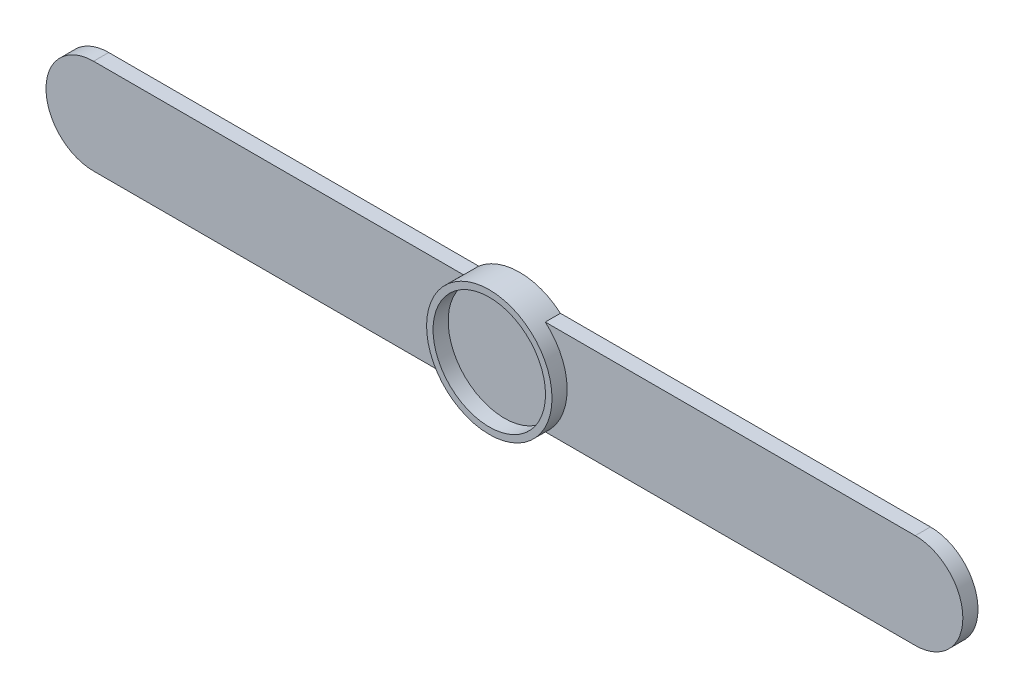
ISO-10303-21;
HEADER;
FILE_DESCRIPTION(('STEP AP214'),'2;1');
FILE_NAME('part.step','',(''),(''),'','','');
FILE_SCHEMA(('AUTOMOTIVE_DESIGN { 1 0 10303 214 1 1 1 1 }'));
ENDSEC;
DATA;
#1=APPLICATION_CONTEXT('core data for automotive mechanical design processes');
#2=APPLICATION_PROTOCOL_DEFINITION('international standard','automotive_design',2000,#1);
#3=PRODUCT_CONTEXT('',#1,'mechanical');
#4=PRODUCT('Part','Part','',(#3));
#5=PRODUCT_RELATED_PRODUCT_CATEGORY('part','',(#4));
#6=PRODUCT_DEFINITION_FORMATION('','',#4);
#7=PRODUCT_DEFINITION_CONTEXT('part definition',#1,'design');
#8=PRODUCT_DEFINITION('design','',#6,#7);
#9=PRODUCT_DEFINITION_SHAPE('','',#8);
#10=(LENGTH_UNIT() NAMED_UNIT(*) SI_UNIT(.MILLI.,.METRE.));
#11=(NAMED_UNIT(*) PLANE_ANGLE_UNIT() SI_UNIT($,.RADIAN.));
#12=(NAMED_UNIT(*) SI_UNIT($,.STERADIAN.) SOLID_ANGLE_UNIT());
#13=UNCERTAINTY_MEASURE_WITH_UNIT(LENGTH_MEASURE(1.E-05),#10,'distance_accuracy_value','');
#14=(GEOMETRIC_REPRESENTATION_CONTEXT(3) GLOBAL_UNCERTAINTY_ASSIGNED_CONTEXT((#13)) GLOBAL_UNIT_ASSIGNED_CONTEXT((#10,
#11,#12)) REPRESENTATION_CONTEXT('',''));
#15=CARTESIAN_POINT('',(0.,0.,0.));
#16=DIRECTION('',(0.,0.,1.));
#17=DIRECTION('',(1.,0.,0.));
#18=AXIS2_PLACEMENT_3D('',#15,#16,#17);
#19=CARTESIAN_POINT('',(0.,0.,3.5));
#20=DIRECTION('',(0.,0.,1.));
#21=DIRECTION('',(1.,0.,0.));
#22=AXIS2_PLACEMENT_3D('',#19,#20,#21);
#23=PLANE('',#22);
#24=CARTESIAN_POINT('',(0.,0.,3.5));
#25=DIRECTION('',(0.,0.,1.));
#26=DIRECTION('',(1.,0.,0.));
#27=AXIS2_PLACEMENT_3D('',#24,#25,#26);
#28=CIRCLE('',#27,14.5);
#29=CARTESIAN_POINT('',(-9.44722181384559,11.,3.5));
#30=VERTEX_POINT('',#29);
#31=CARTESIAN_POINT('',(-9.44722181384559,-11.,3.5));
#32=VERTEX_POINT('',#31);
#33=EDGE_CURVE('E12',#30,#32,#28,.T.);
#34=ORIENTED_EDGE('',*,*,#33,.F.);
#35=DIRECTION('',(1.,0.,0.));
#36=VECTOR('',#35,1.);
#37=CARTESIAN_POINT('',(0.,11.,3.5));
#38=LINE('',#37,#36);
#39=CARTESIAN_POINT('',(-95.,11.,3.5));
#40=VERTEX_POINT('',#39);
#41=EDGE_CURVE('E134',#40,#30,#38,.T.);
#42=ORIENTED_EDGE('',*,*,#41,.F.);
#43=CARTESIAN_POINT('',(-95.,0.,3.5));
#44=DIRECTION('',(0.,0.,1.));
#45=DIRECTION('',(1.,0.,0.));
#46=AXIS2_PLACEMENT_3D('',#43,#44,#45);
#47=CIRCLE('',#46,11.);
#48=CARTESIAN_POINT('',(-95.,-11.,3.5));
#49=VERTEX_POINT('',#48);
#50=EDGE_CURVE('E156',#40,#49,#47,.T.);
#51=ORIENTED_EDGE('',*,*,#50,.T.);
#52=DIRECTION('',(1.,0.,0.));
#53=VECTOR('',#52,1.);
#54=CARTESIAN_POINT('',(0.,-11.,3.5));
#55=LINE('',#54,#53);
#56=EDGE_CURVE('E162',#49,#32,#55,.T.);
#57=ORIENTED_EDGE('',*,*,#56,.T.);
#58=EDGE_LOOP('',(#34,#42,#51,#57));
#59=FACE_BOUND('',#58,.T.);
#60=ADVANCED_FACE('F60',(#59),#23,.T.);
#61=CARTESIAN_POINT('',(0.,-11.,3.5));
#62=DIRECTION('',(0.,1.,0.));
#63=DIRECTION('',(0.,0.,1.));
#64=AXIS2_PLACEMENT_3D('',#61,#62,#63);
#65=PLANE('',#64);
#66=DIRECTION('',(0.,0.,-1.));
#67=VECTOR('',#66,1.);
#68=CARTESIAN_POINT('',(9.44722181384559,-11.,3.5));
#69=LINE('',#68,#67);
#70=CARTESIAN_POINT('',(9.44722181384559,-11.,0.));
#71=VERTEX_POINT('',#70);
#72=CARTESIAN_POINT('',(9.44722181384559,-11.,3.5));
#73=VERTEX_POINT('',#72);
#74=EDGE_CURVE('E64',#71,#73,#69,.F.);
#75=ORIENTED_EDGE('',*,*,#74,.F.);
#76=DIRECTION('',(1.,0.,0.));
#77=VECTOR('',#76,1.);
#78=CARTESIAN_POINT('',(0.,-11.,0.));
#79=LINE('',#78,#77);
#80=CARTESIAN_POINT('',(95.,-11.,0.));
#81=VERTEX_POINT('',#80);
#82=EDGE_CURVE('E174',#71,#81,#79,.T.);
#83=ORIENTED_EDGE('',*,*,#82,.T.);
#84=DIRECTION('',(0.,0.,-1.));
#85=VECTOR('',#84,1.);
#86=CARTESIAN_POINT('',(95.,-11.,3.5));
#87=LINE('',#86,#85);
#88=CARTESIAN_POINT('',(95.,-11.,3.5));
#89=VERTEX_POINT('',#88);
#90=EDGE_CURVE('E192',#89,#81,#87,.T.);
#91=ORIENTED_EDGE('',*,*,#90,.F.);
#92=EDGE_CURVE('E160',#73,#89,#55,.T.);
#93=ORIENTED_EDGE('',*,*,#92,.F.);
#94=EDGE_LOOP('',(#75,#83,#91,#93));
#95=FACE_BOUND('',#94,.T.);
#96=ADVANCED_FACE('F226',(#95),#65,.F.);
#97=CARTESIAN_POINT('',(95.,0.,3.5));
#98=DIRECTION('',(0.,0.,-1.));
#99=DIRECTION('',(-1.,0.,0.));
#100=AXIS2_PLACEMENT_3D('',#97,#98,#99);
#101=CYLINDRICAL_SURFACE('',#100,11.);
#102=CARTESIAN_POINT('',(95.,0.,0.));
#103=DIRECTION('',(0.,0.,1.));
#104=DIRECTION('',(1.,0.,0.));
#105=AXIS2_PLACEMENT_3D('',#102,#103,#104);
#106=CIRCLE('',#105,11.);
#107=CARTESIAN_POINT('',(95.,11.,0.));
#108=VERTEX_POINT('',#107);
#109=EDGE_CURVE('E180',#81,#108,#106,.T.);
#110=ORIENTED_EDGE('',*,*,#109,.T.);
#111=DIRECTION('',(0.,0.,-1.));
#112=VECTOR('',#111,1.);
#113=CARTESIAN_POINT('',(95.,11.,3.5));
#114=LINE('',#113,#112);
#115=CARTESIAN_POINT('',(95.,11.,3.5));
#116=VERTEX_POINT('',#115);
#117=EDGE_CURVE('E189',#116,#108,#114,.T.);
#118=ORIENTED_EDGE('',*,*,#117,.F.);
#119=CARTESIAN_POINT('',(95.,0.,3.5));
#120=DIRECTION('',(0.,0.,1.));
#121=DIRECTION('',(1.,0.,0.));
#122=AXIS2_PLACEMENT_3D('',#119,#120,#121);
#123=CIRCLE('',#122,11.);
#124=EDGE_CURVE('E129',#89,#116,#123,.T.);
#125=ORIENTED_EDGE('',*,*,#124,.F.);
#126=ORIENTED_EDGE('',*,*,#90,.T.);
#127=EDGE_LOOP('',(#110,#118,#125,#126));
#128=FACE_BOUND('',#127,.T.);
#129=ADVANCED_FACE('F223',(#128),#101,.T.);
#130=CARTESIAN_POINT('',(0.,11.,3.5));
#131=DIRECTION('',(0.,1.,0.));
#132=DIRECTION('',(0.,0.,1.));
#133=AXIS2_PLACEMENT_3D('',#130,#131,#132);
#134=PLANE('',#133);
#135=DIRECTION('',(1.,0.,0.));
#136=VECTOR('',#135,1.);
#137=CARTESIAN_POINT('',(0.,11.,0.));
#138=LINE('',#137,#136);
#139=CARTESIAN_POINT('',(9.44722181384559,11.,0.));
#140=VERTEX_POINT('',#139);
#141=EDGE_CURVE('E139',#140,#108,#138,.T.);
#142=ORIENTED_EDGE('',*,*,#141,.F.);
#143=DIRECTION('',(0.,0.,-1.));
#144=VECTOR('',#143,1.);
#145=CARTESIAN_POINT('',(9.44722181384559,11.,3.5));
#146=LINE('',#145,#144);
#147=CARTESIAN_POINT('',(9.44722181384559,11.,3.5));
#148=VERTEX_POINT('',#147);
#149=EDGE_CURVE('E137',#140,#148,#146,.F.);
#150=ORIENTED_EDGE('',*,*,#149,.T.);
#151=EDGE_CURVE('E125',#148,#116,#38,.T.);
#152=ORIENTED_EDGE('',*,*,#151,.T.);
#153=ORIENTED_EDGE('',*,*,#117,.T.);
#154=EDGE_LOOP('',(#142,#150,#152,#153));
#155=FACE_BOUND('',#154,.T.);
#156=ADVANCED_FACE('F138',(#155),#134,.T.);
#157=CARTESIAN_POINT('',(0.,0.,0.));
#158=DIRECTION('',(0.,0.,1.));
#159=DIRECTION('',(1.,0.,0.));
#160=AXIS2_PLACEMENT_3D('',#157,#158,#159);
#161=PLANE('',#160);
#162=ORIENTED_EDGE('',*,*,#82,.F.);
#163=CARTESIAN_POINT('',(0.,0.,0.));
#164=DIRECTION('',(0.,0.,1.));
#165=DIRECTION('',(1.,0.,0.));
#166=AXIS2_PLACEMENT_3D('',#163,#164,#165);
#167=CIRCLE('',#166,14.5);
#168=CARTESIAN_POINT('',(-9.44722181384559,-11.,0.));
#169=VERTEX_POINT('',#168);
#170=EDGE_CURVE('E202',#169,#71,#167,.T.);
#171=ORIENTED_EDGE('',*,*,#170,.F.);
#172=CARTESIAN_POINT('',(-95.,-11.,0.));
#173=VERTEX_POINT('',#172);
#174=EDGE_CURVE('E176',#173,#169,#79,.T.);
#175=ORIENTED_EDGE('',*,*,#174,.F.);
#176=CARTESIAN_POINT('',(-95.,0.,0.));
#177=DIRECTION('',(0.,0.,1.));
#178=DIRECTION('',(1.,0.,0.));
#179=AXIS2_PLACEMENT_3D('',#176,#177,#178);
#180=CIRCLE('',#179,11.);
#181=CARTESIAN_POINT('',(-95.,11.,0.));
#182=VERTEX_POINT('',#181);
#183=EDGE_CURVE('E170',#182,#173,#180,.T.);
#184=ORIENTED_EDGE('',*,*,#183,.F.);
#185=CARTESIAN_POINT('',(-9.44722181384559,11.,0.));
#186=VERTEX_POINT('',#185);
#187=EDGE_CURVE('E161',#182,#186,#138,.T.);
#188=ORIENTED_EDGE('',*,*,#187,.T.);
#189=EDGE_CURVE('E175',#140,#186,#167,.T.);
#190=ORIENTED_EDGE('',*,*,#189,.F.);
#191=ORIENTED_EDGE('',*,*,#141,.T.);
#192=ORIENTED_EDGE('',*,*,#109,.F.);
#193=EDGE_LOOP('',(#162,#171,#175,#184,#188,#190,#191,#192));
#194=FACE_BOUND('',#193,.T.);
#195=ADVANCED_FACE('F209',(#194),#161,.F.);
#196=EDGE_CURVE('E70',#73,#148,#28,.T.);
#197=ORIENTED_EDGE('',*,*,#196,.F.);
#198=ORIENTED_EDGE('',*,*,#92,.T.);
#199=ORIENTED_EDGE('',*,*,#124,.T.);
#200=ORIENTED_EDGE('',*,*,#151,.F.);
#201=EDGE_LOOP('',(#197,#198,#199,#200));
#202=FACE_BOUND('',#201,.T.);
#203=ADVANCED_FACE('F127',(#202),#23,.T.);
#204=ORIENTED_EDGE('',*,*,#41,.T.);
#205=DIRECTION('',(0.,0.,-1.));
#206=VECTOR('',#205,1.);
#207=CARTESIAN_POINT('',(-9.44722181384559,11.,3.5));
#208=LINE('',#207,#206);
#209=EDGE_CURVE('E145',#30,#186,#208,.T.);
#210=ORIENTED_EDGE('',*,*,#209,.T.);
#211=ORIENTED_EDGE('',*,*,#187,.F.);
#212=DIRECTION('',(0.,0.,-1.));
#213=VECTOR('',#212,1.);
#214=CARTESIAN_POINT('',(-95.,11.,3.5));
#215=LINE('',#214,#213);
#216=EDGE_CURVE('E169',#40,#182,#215,.T.);
#217=ORIENTED_EDGE('',*,*,#216,.F.);
#218=EDGE_LOOP('',(#204,#210,#211,#217));
#219=FACE_BOUND('',#218,.T.);
#220=ADVANCED_FACE('F220',(#219),#134,.T.);
#221=CARTESIAN_POINT('',(-95.,0.,3.5));
#222=DIRECTION('',(0.,0.,-1.));
#223=DIRECTION('',(-1.,0.,0.));
#224=AXIS2_PLACEMENT_3D('',#221,#222,#223);
#225=CYLINDRICAL_SURFACE('',#224,11.);
#226=ORIENTED_EDGE('',*,*,#183,.T.);
#227=DIRECTION('',(0.,0.,-1.));
#228=VECTOR('',#227,1.);
#229=CARTESIAN_POINT('',(-95.,-11.,3.5));
#230=LINE('',#229,#228);
#231=EDGE_CURVE('E196',#49,#173,#230,.T.);
#232=ORIENTED_EDGE('',*,*,#231,.F.);
#233=ORIENTED_EDGE('',*,*,#50,.F.);
#234=ORIENTED_EDGE('',*,*,#216,.T.);
#235=EDGE_LOOP('',(#226,#232,#233,#234));
#236=FACE_BOUND('',#235,.T.);
#237=ADVANCED_FACE('F217',(#236),#225,.T.);
#238=DIRECTION('',(0.,0.,-1.));
#239=VECTOR('',#238,1.);
#240=CARTESIAN_POINT('',(-9.44722181384559,-11.,3.5));
#241=LINE('',#240,#239);
#242=EDGE_CURVE('E144',#32,#169,#241,.T.);
#243=ORIENTED_EDGE('',*,*,#242,.F.);
#244=ORIENTED_EDGE('',*,*,#56,.F.);
#245=ORIENTED_EDGE('',*,*,#231,.T.);
#246=ORIENTED_EDGE('',*,*,#174,.T.);
#247=EDGE_LOOP('',(#243,#244,#245,#246));
#248=FACE_BOUND('',#247,.T.);
#249=ADVANCED_FACE('F213',(#248),#65,.F.);
#250=CARTESIAN_POINT('',(0.,0.,3.5));
#251=DIRECTION('',(0.,0.,-1.));
#252=DIRECTION('',(-1.,0.,0.));
#253=AXIS2_PLACEMENT_3D('',#250,#251,#252);
#254=CYLINDRICAL_SURFACE('',#253,14.5);
#255=ORIENTED_EDGE('',*,*,#170,.T.);
#256=ORIENTED_EDGE('',*,*,#74,.T.);
#257=ORIENTED_EDGE('',*,*,#196,.T.);
#258=ORIENTED_EDGE('',*,*,#149,.F.);
#259=ORIENTED_EDGE('',*,*,#189,.T.);
#260=ORIENTED_EDGE('',*,*,#209,.F.);
#261=ORIENTED_EDGE('',*,*,#33,.T.);
#262=ORIENTED_EDGE('',*,*,#242,.T.);
#263=EDGE_LOOP('',(#255,#256,#257,#258,#259,#260,#261,#262));
#264=FACE_BOUND('',#263,.T.);
#265=CARTESIAN_POINT('',(0.,0.,7.));
#266=DIRECTION('',(0.,0.,1.));
#267=DIRECTION('',(1.,0.,0.));
#268=AXIS2_PLACEMENT_3D('',#265,#266,#267);
#269=CIRCLE('',#268,14.5);
#270=CARTESIAN_POINT('',(14.5,0.,7.));
#271=VERTEX_POINT('',#270);
#272=EDGE_CURVE('E154',#271,#271,#269,.T.);
#273=ORIENTED_EDGE('',*,*,#272,.F.);
#274=EDGE_LOOP('',(#273));
#275=FACE_BOUND('',#274,.T.);
#276=ADVANCED_FACE('F62',(#264,#275),#254,.T.);
#277=CARTESIAN_POINT('',(0.,0.,7.));
#278=DIRECTION('',(0.,0.,1.));
#279=DIRECTION('',(1.,0.,0.));
#280=AXIS2_PLACEMENT_3D('',#277,#278,#279);
#281=PLANE('',#280);
#282=ORIENTED_EDGE('',*,*,#272,.T.);
#283=EDGE_LOOP('',(#282));
#284=FACE_BOUND('',#283,.T.);
#285=CARTESIAN_POINT('',(0.,0.,7.));
#286=DIRECTION('',(0.,0.,1.));
#287=DIRECTION('',(1.,0.,0.));
#288=AXIS2_PLACEMENT_3D('',#285,#286,#287);
#289=CIRCLE('',#288,13.);
#290=CARTESIAN_POINT('',(13.,0.,7.));
#291=VERTEX_POINT('',#290);
#292=EDGE_CURVE('E231',#291,#291,#289,.T.);
#293=ORIENTED_EDGE('',*,*,#292,.F.);
#294=EDGE_LOOP('',(#293));
#295=FACE_BOUND('',#294,.T.);
#296=ADVANCED_FACE('F243',(#284,#295),#281,.T.);
#297=CARTESIAN_POINT('',(0.,0.,7.));
#298=DIRECTION('',(0.,0.,-1.));
#299=DIRECTION('',(-1.,0.,0.));
#300=AXIS2_PLACEMENT_3D('',#297,#298,#299);
#301=CYLINDRICAL_SURFACE('',#300,13.);
#302=ORIENTED_EDGE('',*,*,#292,.T.);
#303=EDGE_LOOP('',(#302));
#304=FACE_BOUND('',#303,.T.);
#305=CARTESIAN_POINT('',(0.,0.,3.5));
#306=DIRECTION('',(0.,0.,1.));
#307=DIRECTION('',(1.,0.,0.));
#308=AXIS2_PLACEMENT_3D('',#305,#306,#307);
#309=CIRCLE('',#308,13.);
#310=CARTESIAN_POINT('',(13.,0.,3.5));
#311=VERTEX_POINT('',#310);
#312=EDGE_CURVE('E234',#311,#311,#309,.T.);
#313=ORIENTED_EDGE('',*,*,#312,.F.);
#314=EDGE_LOOP('',(#313));
#315=FACE_BOUND('',#314,.T.);
#316=ADVANCED_FACE('F241',(#304,#315),#301,.F.);
#317=ORIENTED_EDGE('',*,*,#312,.T.);
#318=EDGE_LOOP('',(#317));
#319=FACE_BOUND('',#318,.T.);
#320=ADVANCED_FACE('F239',(#319),#23,.T.);
#321=CLOSED_SHELL('',(#60,#96,#129,#156,#195,#203,#220,#237,#249,#276,#296,#316,#320));
#322=MANIFOLD_SOLID_BREP('B2',#321);
#323=ADVANCED_BREP_SHAPE_REPRESENTATION('',(#18,#322),#14);
#324=SHAPE_DEFINITION_REPRESENTATION(#9,#323);
ENDSEC;
END-ISO-10303-21;
